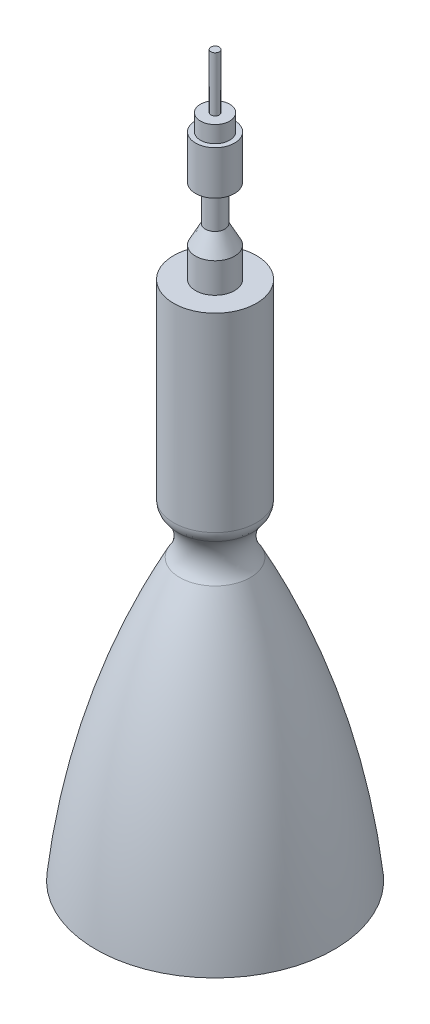
ISO-10303-21;
HEADER;
FILE_DESCRIPTION(('STEP AP214'),'2;1');
FILE_NAME('part.step','',(''),(''),'','','');
FILE_SCHEMA(('AUTOMOTIVE_DESIGN { 1 0 10303 214 1 1 1 1 }'));
ENDSEC;
DATA;
#1=APPLICATION_CONTEXT('core data for automotive mechanical design processes');
#2=APPLICATION_PROTOCOL_DEFINITION('international standard','automotive_design',2000,#1);
#3=PRODUCT_CONTEXT('',#1,'mechanical');
#4=PRODUCT('Part','Part','',(#3));
#5=PRODUCT_RELATED_PRODUCT_CATEGORY('part','',(#4));
#6=PRODUCT_DEFINITION_FORMATION('','',#4);
#7=PRODUCT_DEFINITION_CONTEXT('part definition',#1,'design');
#8=PRODUCT_DEFINITION('design','',#6,#7);
#9=PRODUCT_DEFINITION_SHAPE('','',#8);
#10=(LENGTH_UNIT() NAMED_UNIT(*) SI_UNIT(.MILLI.,.METRE.));
#11=(NAMED_UNIT(*) PLANE_ANGLE_UNIT() SI_UNIT($,.RADIAN.));
#12=(NAMED_UNIT(*) SI_UNIT($,.STERADIAN.) SOLID_ANGLE_UNIT());
#13=UNCERTAINTY_MEASURE_WITH_UNIT(LENGTH_MEASURE(1.E-05),#10,'distance_accuracy_value','');
#14=(GEOMETRIC_REPRESENTATION_CONTEXT(3) GLOBAL_UNCERTAINTY_ASSIGNED_CONTEXT((#13)) GLOBAL_UNIT_ASSIGNED_CONTEXT((#10,
#11,#12)) REPRESENTATION_CONTEXT('',''));
#15=CARTESIAN_POINT('',(0.,0.,0.));
#16=DIRECTION('',(0.,0.,1.));
#17=DIRECTION('',(1.,0.,0.));
#18=AXIS2_PLACEMENT_3D('',#15,#16,#17);
#19=CARTESIAN_POINT('',(26.4077265482884,332.,0.));
#20=DIRECTION('',(0.,1.,0.));
#21=DIRECTION('',(0.,0.,1.));
#22=AXIS2_PLACEMENT_3D('',#19,#20,#21);
#23=PLANE('',#22);
#24=CARTESIAN_POINT('',(0.,332.,0.));
#25=DIRECTION('',(0.,-1.,0.));
#26=DIRECTION('',(0.,0.,-1.));
#27=AXIS2_PLACEMENT_3D('',#24,#25,#26);
#28=CIRCLE('',#27,12.4298989368406);
#29=CARTESIAN_POINT('',(0.,332.,-12.4298989368406));
#30=VERTEX_POINT('',#29);
#31=EDGE_CURVE('E60',#30,#30,#28,.T.);
#32=ORIENTED_EDGE('',*,*,#31,.T.);
#33=EDGE_LOOP('',(#32));
#34=FACE_BOUND('',#33,.T.);
#35=CARTESIAN_POINT('',(0.,332.,0.));
#36=DIRECTION('',(0.,-1.,0.));
#37=DIRECTION('',(0.,0.,-1.));
#38=AXIS2_PLACEMENT_3D('',#35,#36,#37);
#39=CIRCLE('',#38,26.4077265482884);
#40=CARTESIAN_POINT('',(0.,332.,-26.4077265482884));
#41=VERTEX_POINT('',#40);
#42=EDGE_CURVE('E48',#41,#41,#39,.T.);
#43=ORIENTED_EDGE('',*,*,#42,.F.);
#44=EDGE_LOOP('',(#43));
#45=FACE_BOUND('',#44,.T.);
#46=ADVANCED_FACE('F37',(#34,#45),#23,.T.);
#47=CARTESIAN_POINT('',(0.,0.,0.));
#48=DIRECTION('',(0.,-1.,0.));
#49=DIRECTION('',(0.,0.,-1.));
#50=AXIS2_PLACEMENT_3D('',#47,#48,#49);
#51=CYLINDRICAL_SURFACE('',#50,26.4077265482884);
#52=CARTESIAN_POINT('',(0.,210.848627849744,0.));
#53=DIRECTION('',(0.,1.,0.));
#54=DIRECTION('',(0.,0.,1.));
#55=AXIS2_PLACEMENT_3D('',#52,#53,#54);
#56=CIRCLE('',#55,26.4077265482884);
#57=CARTESIAN_POINT('',(0.,210.848627849744,26.4077265482884));
#58=VERTEX_POINT('',#57);
#59=EDGE_CURVE('E10',#58,#58,#56,.T.);
#60=ORIENTED_EDGE('',*,*,#59,.T.);
#61=EDGE_LOOP('',(#60));
#62=FACE_BOUND('',#61,.T.);
#63=ORIENTED_EDGE('',*,*,#42,.T.);
#64=EDGE_LOOP('',(#63));
#65=FACE_BOUND('',#64,.T.);
#66=ADVANCED_FACE('F103',(#62,#65),#51,.T.);
#67=CARTESIAN_POINT('',(0.,190.598809658066,0.));
#68=DIRECTION('',(0.,-1.,0.));
#69=DIRECTION('',(0.,0.,-1.));
#70=AXIS2_PLACEMENT_3D('',#67,#68,#69);
#71=TOROIDAL_SURFACE('',#70,38.3710001307674,19.873743040584);
#72=CARTESIAN_POINT('',(0.,204.070160831343,0.));
#73=DIRECTION('',(0.,-1.,0.));
#74=DIRECTION('',(0.,0.,-1.));
#75=AXIS2_PLACEMENT_3D('',#72,#73,#74);
#76=CIRCLE('',#75,23.7597592522724);
#77=CARTESIAN_POINT('',(0.,204.070160831343,-23.7597592522724));
#78=VERTEX_POINT('',#77);
#79=EDGE_CURVE('E44',#78,#78,#76,.T.);
#80=ORIENTED_EDGE('',*,*,#79,.T.);
#81=EDGE_LOOP('',(#80));
#82=FACE_BOUND('',#81,.T.);
#83=CARTESIAN_POINT('',(0.,178.635536075587,0.));
#84=DIRECTION('',(0.,-1.,0.));
#85=DIRECTION('',(0.,0.,-1.));
#86=AXIS2_PLACEMENT_3D('',#83,#84,#85);
#87=CIRCLE('',#86,22.5013515009482);
#88=CARTESIAN_POINT('',(0.,178.635536075587,-22.5013515009482));
#89=VERTEX_POINT('',#88);
#90=EDGE_CURVE('E52',#89,#89,#87,.T.);
#91=ORIENTED_EDGE('',*,*,#90,.F.);
#92=EDGE_LOOP('',(#91));
#93=FACE_BOUND('',#92,.T.);
#94=ADVANCED_FACE('F108',(#82,#93),#71,.F.);
#95=CARTESIAN_POINT('',(0.,-49.4751957451967,0.));
#96=DIRECTION('',(0.,-1.,0.));
#97=DIRECTION('',(0.,0.,-1.));
#98=AXIS2_PLACEMENT_3D('',#95,#96,#97);
#99=DEGENERATE_TOROIDAL_SURFACE('',#98,414.188236904176,492.678701176791,.F.);
#100=ORIENTED_EDGE('',*,*,#90,.T.);
#101=EDGE_LOOP('',(#100));
#102=FACE_BOUND('',#101,.T.);
#103=CARTESIAN_POINT('',(0.,0.,0.));
#104=DIRECTION('',(0.,-1.,0.));
#105=DIRECTION('',(0.,0.,-1.));
#106=AXIS2_PLACEMENT_3D('',#103,#104,#105);
#107=CIRCLE('',#106,76.);
#108=CARTESIAN_POINT('',(0.,0.,-76.));
#109=VERTEX_POINT('',#108);
#110=EDGE_CURVE('E57',#109,#109,#107,.T.);
#111=ORIENTED_EDGE('',*,*,#110,.F.);
#112=EDGE_LOOP('',(#111));
#113=FACE_BOUND('',#112,.T.);
#114=ADVANCED_FACE('F114',(#102,#113),#99,.F.);
#115=CARTESIAN_POINT('',(0.,0.,0.));
#116=DIRECTION('',(0.,-1.,0.));
#117=DIRECTION('',(0.,0.,-1.));
#118=AXIS2_PLACEMENT_3D('',#115,#116,#117);
#119=PLANE('',#118);
#120=ORIENTED_EDGE('',*,*,#110,.T.);
#121=EDGE_LOOP('',(#120));
#122=FACE_BOUND('',#121,.T.);
#123=ADVANCED_FACE('F117',(#122),#119,.T.);
#124=CARTESIAN_POINT('',(0.,210.848627849744,0.));
#125=DIRECTION('',(0.,1.,0.));
#126=DIRECTION('',(0.,0.,1.));
#127=AXIS2_PLACEMENT_3D('',#124,#125,#126);
#128=TOROIDAL_SURFACE('',#127,16.4077265482884,10.);
#129=ORIENTED_EDGE('',*,*,#59,.F.);
#130=EDGE_LOOP('',(#129));
#131=FACE_BOUND('',#130,.T.);
#132=ORIENTED_EDGE('',*,*,#79,.F.);
#133=EDGE_LOOP('',(#132));
#134=FACE_BOUND('',#133,.T.);
#135=ADVANCED_FACE('F39',(#131,#134),#128,.T.);
#136=CARTESIAN_POINT('',(0.,332.,0.));
#137=DIRECTION('',(0.,-1.,0.));
#138=DIRECTION('',(0.,0.,-1.));
#139=AXIS2_PLACEMENT_3D('',#136,#137,#138);
#140=CYLINDRICAL_SURFACE('',#139,12.4298989368406);
#141=CARTESIAN_POINT('',(0.,351.071174056437,0.));
#142=DIRECTION('',(0.,-1.,0.));
#143=DIRECTION('',(0.,0.,-1.));
#144=AXIS2_PLACEMENT_3D('',#141,#142,#143);
#145=CIRCLE('',#144,12.4298989368406);
#146=CARTESIAN_POINT('',(0.,351.071174056437,-12.4298989368406));
#147=VERTEX_POINT('',#146);
#148=EDGE_CURVE('E63',#147,#147,#145,.T.);
#149=ORIENTED_EDGE('',*,*,#148,.T.);
#150=EDGE_LOOP('',(#149));
#151=FACE_BOUND('',#150,.T.);
#152=ORIENTED_EDGE('',*,*,#31,.F.);
#153=EDGE_LOOP('',(#152));
#154=FACE_BOUND('',#153,.T.);
#155=ADVANCED_FACE('F122',(#151,#154),#140,.T.);
#156=CARTESIAN_POINT('',(0.,351.071174056437,0.));
#157=DIRECTION('',(0.,-1.,0.));
#158=DIRECTION('',(0.,0.,-1.));
#159=AXIS2_PLACEMENT_3D('',#156,#157,#158);
#160=CONICAL_SURFACE('',#159,12.4298989368406,0.485498449797116);
#161=CARTESIAN_POINT('',(0.,362.850395764796,0.));
#162=DIRECTION('',(0.,-1.,0.));
#163=DIRECTION('',(0.,0.,-1.));
#164=AXIS2_PLACEMENT_3D('',#161,#162,#163);
#165=CIRCLE('',#164,6.21494946842029);
#166=CARTESIAN_POINT('',(0.,362.850395764796,-6.21494946842029));
#167=VERTEX_POINT('',#166);
#168=EDGE_CURVE('E66',#167,#167,#165,.T.);
#169=ORIENTED_EDGE('',*,*,#168,.T.);
#170=EDGE_LOOP('',(#169));
#171=FACE_BOUND('',#170,.T.);
#172=ORIENTED_EDGE('',*,*,#148,.F.);
#173=EDGE_LOOP('',(#172));
#174=FACE_BOUND('',#173,.T.);
#175=ADVANCED_FACE('F125',(#171,#174),#160,.T.);
#176=CARTESIAN_POINT('',(0.,332.,0.));
#177=DIRECTION('',(0.,-1.,0.));
#178=DIRECTION('',(0.,0.,-1.));
#179=AXIS2_PLACEMENT_3D('',#176,#177,#178);
#180=CYLINDRICAL_SURFACE('',#179,6.21494946842029);
#181=CARTESIAN_POINT('',(0.,385.623557734291,0.));
#182=DIRECTION('',(0.,-1.,0.));
#183=DIRECTION('',(0.,0.,-1.));
#184=AXIS2_PLACEMENT_3D('',#181,#182,#183);
#185=CIRCLE('',#184,6.21494946842029);
#186=CARTESIAN_POINT('',(0.,385.623557734291,-6.21494946842029));
#187=VERTEX_POINT('',#186);
#188=EDGE_CURVE('E69',#187,#187,#185,.T.);
#189=ORIENTED_EDGE('',*,*,#188,.T.);
#190=EDGE_LOOP('',(#189));
#191=FACE_BOUND('',#190,.T.);
#192=ORIENTED_EDGE('',*,*,#168,.F.);
#193=EDGE_LOOP('',(#192));
#194=FACE_BOUND('',#193,.T.);
#195=ADVANCED_FACE('F129',(#191,#194),#180,.T.);
#196=CARTESIAN_POINT('',(6.21494946842029,385.623557734291,0.));
#197=DIRECTION('',(0.,-1.,0.));
#198=DIRECTION('',(0.,0.,-1.));
#199=AXIS2_PLACEMENT_3D('',#196,#197,#198);
#200=PLANE('',#199);
#201=CARTESIAN_POINT('',(0.,385.623557734291,0.));
#202=DIRECTION('',(0.,-1.,0.));
#203=DIRECTION('',(0.,0.,-1.));
#204=AXIS2_PLACEMENT_3D('',#201,#202,#203);
#205=CIRCLE('',#204,12.4298989368406);
#206=CARTESIAN_POINT('',(0.,385.623557734291,-12.4298989368406));
#207=VERTEX_POINT('',#206);
#208=EDGE_CURVE('E72',#207,#207,#205,.T.);
#209=ORIENTED_EDGE('',*,*,#208,.T.);
#210=EDGE_LOOP('',(#209));
#211=FACE_BOUND('',#210,.T.);
#212=ORIENTED_EDGE('',*,*,#188,.F.);
#213=EDGE_LOOP('',(#212));
#214=FACE_BOUND('',#213,.T.);
#215=ADVANCED_FACE('F133',(#211,#214),#200,.T.);
#216=CARTESIAN_POINT('',(0.,332.,0.));
#217=DIRECTION('',(0.,-1.,0.));
#218=DIRECTION('',(0.,0.,-1.));
#219=AXIS2_PLACEMENT_3D('',#216,#217,#218);
#220=CYLINDRICAL_SURFACE('',#219,12.4298989368406);
#221=CARTESIAN_POINT('',(0.,413.501049110741,0.));
#222=DIRECTION('',(0.,-1.,0.));
#223=DIRECTION('',(0.,0.,-1.));
#224=AXIS2_PLACEMENT_3D('',#221,#222,#223);
#225=CIRCLE('',#224,12.4298989368406);
#226=CARTESIAN_POINT('',(0.,413.501049110741,-12.4298989368406));
#227=VERTEX_POINT('',#226);
#228=EDGE_CURVE('E75',#227,#227,#225,.T.);
#229=ORIENTED_EDGE('',*,*,#228,.T.);
#230=EDGE_LOOP('',(#229));
#231=FACE_BOUND('',#230,.T.);
#232=ORIENTED_EDGE('',*,*,#208,.F.);
#233=EDGE_LOOP('',(#232));
#234=FACE_BOUND('',#233,.T.);
#235=ADVANCED_FACE('F137',(#231,#234),#220,.T.);
#236=CARTESIAN_POINT('',(12.4298989368406,413.501049110741,0.));
#237=DIRECTION('',(0.,1.,0.));
#238=DIRECTION('',(0.,0.,1.));
#239=AXIS2_PLACEMENT_3D('',#236,#237,#238);
#240=PLANE('',#239);
#241=CARTESIAN_POINT('',(0.,413.501049110741,0.));
#242=DIRECTION('',(0.,-1.,0.));
#243=DIRECTION('',(0.,0.,-1.));
#244=AXIS2_PLACEMENT_3D('',#241,#242,#243);
#245=CIRCLE('',#244,9.32242420263043);
#246=CARTESIAN_POINT('',(0.,413.501049110741,-9.32242420263043));
#247=VERTEX_POINT('',#246);
#248=EDGE_CURVE('E78',#247,#247,#245,.T.);
#249=ORIENTED_EDGE('',*,*,#248,.T.);
#250=EDGE_LOOP('',(#249));
#251=FACE_BOUND('',#250,.T.);
#252=ORIENTED_EDGE('',*,*,#228,.F.);
#253=EDGE_LOOP('',(#252));
#254=FACE_BOUND('',#253,.T.);
#255=ADVANCED_FACE('F141',(#251,#254),#240,.T.);
#256=CARTESIAN_POINT('',(0.,332.,0.));
#257=DIRECTION('',(0.,-1.,0.));
#258=DIRECTION('',(0.,0.,-1.));
#259=AXIS2_PLACEMENT_3D('',#256,#257,#258);
#260=CYLINDRICAL_SURFACE('',#259,9.32242420263043);
#261=CARTESIAN_POINT('',(0.,424.102348648264,0.));
#262=DIRECTION('',(0.,-1.,0.));
#263=DIRECTION('',(0.,0.,-1.));
#264=AXIS2_PLACEMENT_3D('',#261,#262,#263);
#265=CIRCLE('',#264,9.32242420263043);
#266=CARTESIAN_POINT('',(0.,424.102348648264,-9.32242420263043));
#267=VERTEX_POINT('',#266);
#268=EDGE_CURVE('E81',#267,#267,#265,.T.);
#269=ORIENTED_EDGE('',*,*,#268,.T.);
#270=EDGE_LOOP('',(#269));
#271=FACE_BOUND('',#270,.T.);
#272=ORIENTED_EDGE('',*,*,#248,.F.);
#273=EDGE_LOOP('',(#272));
#274=FACE_BOUND('',#273,.T.);
#275=ADVANCED_FACE('F145',(#271,#274),#260,.T.);
#276=CARTESIAN_POINT('',(9.32242420263043,424.102348648264,0.));
#277=DIRECTION('',(0.,1.,0.));
#278=DIRECTION('',(0.,0.,1.));
#279=AXIS2_PLACEMENT_3D('',#276,#277,#278);
#280=PLANE('',#279);
#281=CARTESIAN_POINT('',(0.,424.102348648264,0.));
#282=DIRECTION('',(0.,-1.,0.));
#283=DIRECTION('',(0.,0.,-1.));
#284=AXIS2_PLACEMENT_3D('',#281,#282,#283);
#285=CIRCLE('',#284,2.66479397733277);
#286=CARTESIAN_POINT('',(0.,424.102348648264,-2.66479397733277));
#287=VERTEX_POINT('',#286);
#288=EDGE_CURVE('E84',#287,#287,#285,.T.);
#289=ORIENTED_EDGE('',*,*,#288,.T.);
#290=EDGE_LOOP('',(#289));
#291=FACE_BOUND('',#290,.T.);
#292=ORIENTED_EDGE('',*,*,#268,.F.);
#293=EDGE_LOOP('',(#292));
#294=FACE_BOUND('',#293,.T.);
#295=ADVANCED_FACE('F100',(#291,#294),#280,.T.);
#296=CARTESIAN_POINT('',(0.,332.,0.));
#297=DIRECTION('',(0.,-1.,0.));
#298=DIRECTION('',(0.,0.,-1.));
#299=AXIS2_PLACEMENT_3D('',#296,#297,#298);
#300=CYLINDRICAL_SURFACE('',#299,2.66479397733277);
#301=CARTESIAN_POINT('',(0.,459.,0.));
#302=DIRECTION('',(0.,-1.,0.));
#303=DIRECTION('',(0.,0.,-1.));
#304=AXIS2_PLACEMENT_3D('',#301,#302,#303);
#305=CIRCLE('',#304,2.66479397733277);
#306=CARTESIAN_POINT('',(0.,459.,-2.66479397733277));
#307=VERTEX_POINT('',#306);
#308=EDGE_CURVE('E87',#307,#307,#305,.T.);
#309=ORIENTED_EDGE('',*,*,#308,.T.);
#310=EDGE_LOOP('',(#309));
#311=FACE_BOUND('',#310,.T.);
#312=ORIENTED_EDGE('',*,*,#288,.F.);
#313=EDGE_LOOP('',(#312));
#314=FACE_BOUND('',#313,.T.);
#315=ADVANCED_FACE('F91',(#311,#314),#300,.T.);
#316=CARTESIAN_POINT('',(2.66479397733277,459.,0.));
#317=DIRECTION('',(0.,1.,0.));
#318=DIRECTION('',(0.,0.,1.));
#319=AXIS2_PLACEMENT_3D('',#316,#317,#318);
#320=PLANE('',#319);
#321=ORIENTED_EDGE('',*,*,#308,.F.);
#322=EDGE_LOOP('',(#321));
#323=FACE_BOUND('',#322,.T.);
#324=ADVANCED_FACE('F94',(#323),#320,.T.);
#325=CLOSED_SHELL('',(#46,#66,#94,#114,#123,#135,#155,#175,#195,#215,#235,#255,#275,#295,#315,#324));
#326=MANIFOLD_SOLID_BREP('B2',#325);
#327=ADVANCED_BREP_SHAPE_REPRESENTATION('',(#18,#326),#14);
#328=SHAPE_DEFINITION_REPRESENTATION(#9,#327);
ENDSEC;
END-ISO-10303-21;
